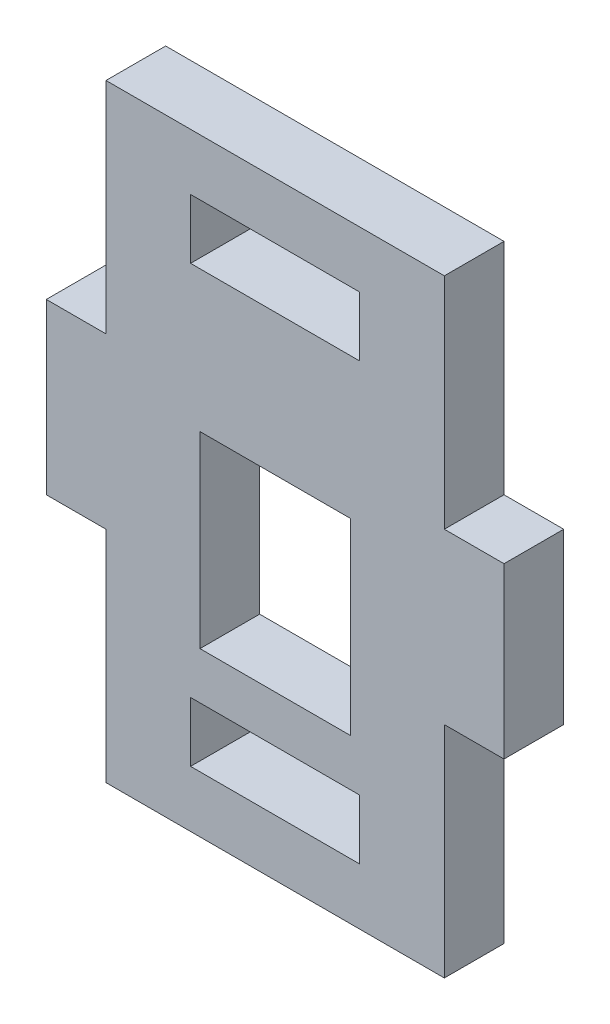
ISO-10303-21;
HEADER;
FILE_DESCRIPTION(('STEP AP214'),'2;1');
FILE_NAME('part.step','',(''),(''),'','','');
FILE_SCHEMA(('AUTOMOTIVE_DESIGN { 1 0 10303 214 1 1 1 1 }'));
ENDSEC;
DATA;
#1=APPLICATION_CONTEXT('core data for automotive mechanical design processes');
#2=APPLICATION_PROTOCOL_DEFINITION('international standard','automotive_design',2000,#1);
#3=PRODUCT_CONTEXT('',#1,'mechanical');
#4=PRODUCT('Part','Part','',(#3));
#5=PRODUCT_RELATED_PRODUCT_CATEGORY('part','',(#4));
#6=PRODUCT_DEFINITION_FORMATION('','',#4);
#7=PRODUCT_DEFINITION_CONTEXT('part definition',#1,'design');
#8=PRODUCT_DEFINITION('design','',#6,#7);
#9=PRODUCT_DEFINITION_SHAPE('','',#8);
#10=(LENGTH_UNIT() NAMED_UNIT(*) SI_UNIT(.MILLI.,.METRE.));
#11=(NAMED_UNIT(*) PLANE_ANGLE_UNIT() SI_UNIT($,.RADIAN.));
#12=(NAMED_UNIT(*) SI_UNIT($,.STERADIAN.) SOLID_ANGLE_UNIT());
#13=UNCERTAINTY_MEASURE_WITH_UNIT(LENGTH_MEASURE(1.E-05),#10,'distance_accuracy_value','');
#14=(GEOMETRIC_REPRESENTATION_CONTEXT(3) GLOBAL_UNCERTAINTY_ASSIGNED_CONTEXT((#13)) GLOBAL_UNIT_ASSIGNED_CONTEXT((#10,
#11,#12)) REPRESENTATION_CONTEXT('',''));
#15=CARTESIAN_POINT('',(0.,0.,0.));
#16=DIRECTION('',(0.,0.,1.));
#17=DIRECTION('',(1.,0.,0.));
#18=AXIS2_PLACEMENT_3D('',#15,#16,#17);
#19=CARTESIAN_POINT('',(0.,3.,1.5875));
#20=DIRECTION('',(0.,-1.,0.));
#21=DIRECTION('',(0.,0.,-1.));
#22=AXIS2_PLACEMENT_3D('',#19,#20,#21);
#23=PLANE('',#22);
#24=DIRECTION('',(-1.,0.,0.));
#25=VECTOR('',#24,1.);
#26=CARTESIAN_POINT('',(0.,3.,-1.5875));
#27=LINE('',#26,#25);
#28=CARTESIAN_POINT('',(13.5,3.,-1.5875));
#29=VERTEX_POINT('',#28);
#30=CARTESIAN_POINT('',(4.5,3.,-1.5875));
#31=VERTEX_POINT('',#30);
#32=EDGE_CURVE('E275',#29,#31,#27,.T.);
#33=ORIENTED_EDGE('',*,*,#32,.T.);
#34=DIRECTION('',(0.,0.,-1.));
#35=VECTOR('',#34,1.);
#36=CARTESIAN_POINT('',(4.5,3.,1.5875));
#37=LINE('',#36,#35);
#38=CARTESIAN_POINT('',(4.5,3.,1.5875));
#39=VERTEX_POINT('',#38);
#40=EDGE_CURVE('E11',#39,#31,#37,.T.);
#41=ORIENTED_EDGE('',*,*,#40,.F.);
#42=DIRECTION('',(-1.,0.,0.));
#43=VECTOR('',#42,1.);
#44=CARTESIAN_POINT('',(0.,3.,1.5875));
#45=LINE('',#44,#43);
#46=CARTESIAN_POINT('',(13.5,3.,1.5875));
#47=VERTEX_POINT('',#46);
#48=EDGE_CURVE('E212',#47,#39,#45,.T.);
#49=ORIENTED_EDGE('',*,*,#48,.F.);
#50=DIRECTION('',(0.,0.,-1.));
#51=VECTOR('',#50,1.);
#52=CARTESIAN_POINT('',(13.5,3.,1.5875));
#53=LINE('',#52,#51);
#54=EDGE_CURVE('E282',#47,#29,#53,.T.);
#55=ORIENTED_EDGE('',*,*,#54,.T.);
#56=EDGE_LOOP('',(#33,#41,#49,#55));
#57=FACE_BOUND('',#56,.T.);
#58=ADVANCED_FACE('F34',(#57),#23,.F.);
#59=CARTESIAN_POINT('',(4.5,0.,1.5875));
#60=DIRECTION('',(-1.,0.,0.));
#61=DIRECTION('',(0.,0.,1.));
#62=AXIS2_PLACEMENT_3D('',#59,#60,#61);
#63=PLANE('',#62);
#64=DIRECTION('',(0.,1.,0.));
#65=VECTOR('',#64,1.);
#66=CARTESIAN_POINT('',(4.5,0.,-1.5875));
#67=LINE('',#66,#65);
#68=CARTESIAN_POINT('',(4.5,6.175,-1.5875));
#69=VERTEX_POINT('',#68);
#70=EDGE_CURVE('E217',#31,#69,#67,.T.);
#71=ORIENTED_EDGE('',*,*,#70,.T.);
#72=DIRECTION('',(0.,0.,-1.));
#73=VECTOR('',#72,1.);
#74=CARTESIAN_POINT('',(4.5,6.175,1.5875));
#75=LINE('',#74,#73);
#76=CARTESIAN_POINT('',(4.5,6.175,1.5875));
#77=VERTEX_POINT('',#76);
#78=EDGE_CURVE('E44',#77,#69,#75,.T.);
#79=ORIENTED_EDGE('',*,*,#78,.F.);
#80=DIRECTION('',(0.,1.,0.));
#81=VECTOR('',#80,1.);
#82=CARTESIAN_POINT('',(4.5,0.,1.5875));
#83=LINE('',#82,#81);
#84=EDGE_CURVE('E206',#39,#77,#83,.T.);
#85=ORIENTED_EDGE('',*,*,#84,.F.);
#86=ORIENTED_EDGE('',*,*,#40,.T.);
#87=EDGE_LOOP('',(#71,#79,#85,#86));
#88=FACE_BOUND('',#87,.T.);
#89=ADVANCED_FACE('F216',(#88),#63,.F.);
#90=CARTESIAN_POINT('',(0.,6.175,1.5875));
#91=DIRECTION('',(0.,1.,0.));
#92=DIRECTION('',(-1.,0.,0.));
#93=AXIS2_PLACEMENT_3D('',#90,#91,#92);
#94=PLANE('',#93);
#95=DIRECTION('',(1.,0.,0.));
#96=VECTOR('',#95,1.);
#97=CARTESIAN_POINT('',(0.,6.175,-1.5875));
#98=LINE('',#97,#96);
#99=CARTESIAN_POINT('',(13.5,6.175,-1.5875));
#100=VERTEX_POINT('',#99);
#101=EDGE_CURVE('E130',#69,#100,#98,.T.);
#102=ORIENTED_EDGE('',*,*,#101,.T.);
#103=DIRECTION('',(0.,0.,-1.));
#104=VECTOR('',#103,1.);
#105=CARTESIAN_POINT('',(13.5,6.175,1.5875));
#106=LINE('',#105,#104);
#107=CARTESIAN_POINT('',(13.5,6.175,1.5875));
#108=VERTEX_POINT('',#107);
#109=EDGE_CURVE('E218',#108,#100,#106,.T.);
#110=ORIENTED_EDGE('',*,*,#109,.F.);
#111=DIRECTION('',(1.,0.,0.));
#112=VECTOR('',#111,1.);
#113=CARTESIAN_POINT('',(0.,6.175,1.5875));
#114=LINE('',#113,#112);
#115=EDGE_CURVE('E210',#77,#108,#114,.T.);
#116=ORIENTED_EDGE('',*,*,#115,.F.);
#117=ORIENTED_EDGE('',*,*,#78,.T.);
#118=EDGE_LOOP('',(#102,#110,#116,#117));
#119=FACE_BOUND('',#118,.T.);
#120=ADVANCED_FACE('F220',(#119),#94,.F.);
#121=CARTESIAN_POINT('',(0.,29.35,1.5875));
#122=DIRECTION('',(0.,-1.,0.));
#123=DIRECTION('',(0.,0.,-1.));
#124=AXIS2_PLACEMENT_3D('',#121,#122,#123);
#125=PLANE('',#124);
#126=DIRECTION('',(-1.,0.,0.));
#127=VECTOR('',#126,1.);
#128=CARTESIAN_POINT('',(0.,29.35,-1.5875));
#129=LINE('',#128,#127);
#130=CARTESIAN_POINT('',(13.5,29.35,-1.5875));
#131=VERTEX_POINT('',#130);
#132=CARTESIAN_POINT('',(4.5,29.35,-1.5875));
#133=VERTEX_POINT('',#132);
#134=EDGE_CURVE('E263',#131,#133,#129,.T.);
#135=ORIENTED_EDGE('',*,*,#134,.F.);
#136=DIRECTION('',(0.,0.,-1.));
#137=VECTOR('',#136,1.);
#138=CARTESIAN_POINT('',(13.5,29.35,1.5875));
#139=LINE('',#138,#137);
#140=CARTESIAN_POINT('',(13.5,29.35,1.5875));
#141=VERTEX_POINT('',#140);
#142=EDGE_CURVE('E284',#141,#131,#139,.T.);
#143=ORIENTED_EDGE('',*,*,#142,.F.);
#144=DIRECTION('',(-1.,0.,0.));
#145=VECTOR('',#144,1.);
#146=CARTESIAN_POINT('',(0.,29.35,1.5875));
#147=LINE('',#146,#145);
#148=CARTESIAN_POINT('',(4.5,29.35,1.5875));
#149=VERTEX_POINT('',#148);
#150=EDGE_CURVE('E389',#141,#149,#147,.T.);
#151=ORIENTED_EDGE('',*,*,#150,.T.);
#152=DIRECTION('',(0.,0.,-1.));
#153=VECTOR('',#152,1.);
#154=CARTESIAN_POINT('',(4.5,29.35,1.5875));
#155=LINE('',#154,#153);
#156=EDGE_CURVE('E286',#149,#133,#155,.T.);
#157=ORIENTED_EDGE('',*,*,#156,.T.);
#158=EDGE_LOOP('',(#135,#143,#151,#157));
#159=FACE_BOUND('',#158,.T.);
#160=ADVANCED_FACE('F416',(#159),#125,.T.);
#161=CARTESIAN_POINT('',(13.5,0.,1.5875));
#162=DIRECTION('',(-1.,0.,0.));
#163=DIRECTION('',(0.,0.,1.));
#164=AXIS2_PLACEMENT_3D('',#161,#162,#163);
#165=PLANE('',#164);
#166=DIRECTION('',(0.,1.,0.));
#167=VECTOR('',#166,1.);
#168=CARTESIAN_POINT('',(13.5,0.,-1.5875));
#169=LINE('',#168,#167);
#170=CARTESIAN_POINT('',(13.5,26.175,-1.5875));
#171=VERTEX_POINT('',#170);
#172=EDGE_CURVE('E266',#171,#131,#169,.T.);
#173=ORIENTED_EDGE('',*,*,#172,.F.);
#174=DIRECTION('',(0.,0.,-1.));
#175=VECTOR('',#174,1.);
#176=CARTESIAN_POINT('',(13.5,26.175,1.5875));
#177=LINE('',#176,#175);
#178=CARTESIAN_POINT('',(13.5,26.175,1.5875));
#179=VERTEX_POINT('',#178);
#180=EDGE_CURVE('E291',#179,#171,#177,.T.);
#181=ORIENTED_EDGE('',*,*,#180,.F.);
#182=DIRECTION('',(0.,1.,0.));
#183=VECTOR('',#182,1.);
#184=CARTESIAN_POINT('',(13.5,0.,1.5875));
#185=LINE('',#184,#183);
#186=EDGE_CURVE('E392',#179,#141,#185,.T.);
#187=ORIENTED_EDGE('',*,*,#186,.T.);
#188=ORIENTED_EDGE('',*,*,#142,.T.);
#189=EDGE_LOOP('',(#173,#181,#187,#188));
#190=FACE_BOUND('',#189,.T.);
#191=ADVANCED_FACE('F418',(#190),#165,.T.);
#192=CARTESIAN_POINT('',(0.,26.175,1.5875));
#193=DIRECTION('',(0.,1.,0.));
#194=DIRECTION('',(-1.,0.,0.));
#195=AXIS2_PLACEMENT_3D('',#192,#193,#194);
#196=PLANE('',#195);
#197=DIRECTION('',(1.,0.,0.));
#198=VECTOR('',#197,1.);
#199=CARTESIAN_POINT('',(0.,26.175,-1.5875));
#200=LINE('',#199,#198);
#201=CARTESIAN_POINT('',(4.5,26.175,-1.5875));
#202=VERTEX_POINT('',#201);
#203=EDGE_CURVE('E269',#202,#171,#200,.T.);
#204=ORIENTED_EDGE('',*,*,#203,.F.);
#205=DIRECTION('',(0.,0.,-1.));
#206=VECTOR('',#205,1.);
#207=CARTESIAN_POINT('',(4.5,26.175,1.5875));
#208=LINE('',#207,#206);
#209=CARTESIAN_POINT('',(4.5,26.175,1.5875));
#210=VERTEX_POINT('',#209);
#211=EDGE_CURVE('E288',#210,#202,#208,.T.);
#212=ORIENTED_EDGE('',*,*,#211,.F.);
#213=DIRECTION('',(1.,0.,0.));
#214=VECTOR('',#213,1.);
#215=CARTESIAN_POINT('',(0.,26.175,1.5875));
#216=LINE('',#215,#214);
#217=EDGE_CURVE('E395',#210,#179,#216,.T.);
#218=ORIENTED_EDGE('',*,*,#217,.T.);
#219=ORIENTED_EDGE('',*,*,#180,.T.);
#220=EDGE_LOOP('',(#204,#212,#218,#219));
#221=FACE_BOUND('',#220,.T.);
#222=ADVANCED_FACE('F410',(#221),#196,.T.);
#223=CARTESIAN_POINT('',(0.,8.675,1.5875));
#224=DIRECTION('',(0.,1.,0.));
#225=DIRECTION('',(0.,0.,1.));
#226=AXIS2_PLACEMENT_3D('',#223,#224,#225);
#227=PLANE('',#226);
#228=DIRECTION('',(1.,0.,0.));
#229=VECTOR('',#228,1.);
#230=CARTESIAN_POINT('',(0.,8.675,-1.5875));
#231=LINE('',#230,#229);
#232=CARTESIAN_POINT('',(5.,8.675,-1.5875));
#233=VERTEX_POINT('',#232);
#234=CARTESIAN_POINT('',(13.,8.675,-1.5875));
#235=VERTEX_POINT('',#234);
#236=EDGE_CURVE('E251',#233,#235,#231,.T.);
#237=ORIENTED_EDGE('',*,*,#236,.F.);
#238=DIRECTION('',(0.,0.,-1.));
#239=VECTOR('',#238,1.);
#240=CARTESIAN_POINT('',(5.,8.675,1.5875));
#241=LINE('',#240,#239);
#242=CARTESIAN_POINT('',(5.,8.675,1.5875));
#243=VERTEX_POINT('',#242);
#244=EDGE_CURVE('E289',#243,#233,#241,.T.);
#245=ORIENTED_EDGE('',*,*,#244,.F.);
#246=DIRECTION('',(1.,0.,0.));
#247=VECTOR('',#246,1.);
#248=CARTESIAN_POINT('',(0.,8.675,1.5875));
#249=LINE('',#248,#247);
#250=CARTESIAN_POINT('',(13.,8.675,1.5875));
#251=VERTEX_POINT('',#250);
#252=EDGE_CURVE('E377',#243,#251,#249,.T.);
#253=ORIENTED_EDGE('',*,*,#252,.T.);
#254=DIRECTION('',(0.,0.,-1.));
#255=VECTOR('',#254,1.);
#256=CARTESIAN_POINT('',(13.,8.675,1.5875));
#257=LINE('',#256,#255);
#258=EDGE_CURVE('E294',#251,#235,#257,.T.);
#259=ORIENTED_EDGE('',*,*,#258,.T.);
#260=EDGE_LOOP('',(#237,#245,#253,#259));
#261=FACE_BOUND('',#260,.T.);
#262=ADVANCED_FACE('F425',(#261),#227,.T.);
#263=CARTESIAN_POINT('',(5.,0.,1.5875));
#264=DIRECTION('',(1.,0.,0.));
#265=DIRECTION('',(0.,1.,0.));
#266=AXIS2_PLACEMENT_3D('',#263,#264,#265);
#267=PLANE('',#266);
#268=DIRECTION('',(0.,-1.,0.));
#269=VECTOR('',#268,1.);
#270=CARTESIAN_POINT('',(5.,0.,-1.5875));
#271=LINE('',#270,#269);
#272=CARTESIAN_POINT('',(5.,18.675,-1.5875));
#273=VERTEX_POINT('',#272);
#274=EDGE_CURVE('E254',#273,#233,#271,.T.);
#275=ORIENTED_EDGE('',*,*,#274,.F.);
#276=DIRECTION('',(0.,0.,-1.));
#277=VECTOR('',#276,1.);
#278=CARTESIAN_POINT('',(5.,18.675,1.5875));
#279=LINE('',#278,#277);
#280=CARTESIAN_POINT('',(5.,18.675,1.5875));
#281=VERTEX_POINT('',#280);
#282=EDGE_CURVE('E298',#281,#273,#279,.T.);
#283=ORIENTED_EDGE('',*,*,#282,.F.);
#284=DIRECTION('',(0.,-1.,0.));
#285=VECTOR('',#284,1.);
#286=CARTESIAN_POINT('',(5.,0.,1.5875));
#287=LINE('',#286,#285);
#288=EDGE_CURVE('E380',#281,#243,#287,.T.);
#289=ORIENTED_EDGE('',*,*,#288,.T.);
#290=ORIENTED_EDGE('',*,*,#244,.T.);
#291=EDGE_LOOP('',(#275,#283,#289,#290));
#292=FACE_BOUND('',#291,.T.);
#293=ADVANCED_FACE('F489',(#292),#267,.T.);
#294=CARTESIAN_POINT('',(0.,18.675,1.5875));
#295=DIRECTION('',(0.,-1.,0.));
#296=DIRECTION('',(0.,0.,-1.));
#297=AXIS2_PLACEMENT_3D('',#294,#295,#296);
#298=PLANE('',#297);
#299=DIRECTION('',(-1.,0.,0.));
#300=VECTOR('',#299,1.);
#301=CARTESIAN_POINT('',(0.,18.675,-1.5875));
#302=LINE('',#301,#300);
#303=CARTESIAN_POINT('',(13.,18.675,-1.5875));
#304=VERTEX_POINT('',#303);
#305=EDGE_CURVE('E257',#304,#273,#302,.T.);
#306=ORIENTED_EDGE('',*,*,#305,.F.);
#307=DIRECTION('',(0.,0.,-1.));
#308=VECTOR('',#307,1.);
#309=CARTESIAN_POINT('',(13.,18.675,1.5875));
#310=LINE('',#309,#308);
#311=CARTESIAN_POINT('',(13.,18.675,1.5875));
#312=VERTEX_POINT('',#311);
#313=EDGE_CURVE('E296',#312,#304,#310,.T.);
#314=ORIENTED_EDGE('',*,*,#313,.F.);
#315=DIRECTION('',(-1.,0.,0.));
#316=VECTOR('',#315,1.);
#317=CARTESIAN_POINT('',(0.,18.675,1.5875));
#318=LINE('',#317,#316);
#319=EDGE_CURVE('E383',#312,#281,#318,.T.);
#320=ORIENTED_EDGE('',*,*,#319,.T.);
#321=ORIENTED_EDGE('',*,*,#282,.T.);
#322=EDGE_LOOP('',(#306,#314,#320,#321));
#323=FACE_BOUND('',#322,.T.);
#324=ADVANCED_FACE('F485',(#323),#298,.T.);
#325=CARTESIAN_POINT('',(0.,20.675,1.5875));
#326=DIRECTION('',(0.,-1.,0.));
#327=DIRECTION('',(0.,0.,-1.));
#328=AXIS2_PLACEMENT_3D('',#325,#326,#327);
#329=PLANE('',#328);
#330=DIRECTION('',(-1.,0.,0.));
#331=VECTOR('',#330,1.);
#332=CARTESIAN_POINT('',(0.,20.675,-1.5875));
#333=LINE('',#332,#331);
#334=CARTESIAN_POINT('',(21.175,20.675,-1.5875));
#335=VERTEX_POINT('',#334);
#336=CARTESIAN_POINT('',(18.,20.675,-1.5875));
#337=VERTEX_POINT('',#336);
#338=EDGE_CURVE('E226',#335,#337,#333,.T.);
#339=ORIENTED_EDGE('',*,*,#338,.T.);
#340=DIRECTION('',(0.,0.,-1.));
#341=VECTOR('',#340,1.);
#342=CARTESIAN_POINT('',(18.,20.675,1.5875));
#343=LINE('',#342,#341);
#344=CARTESIAN_POINT('',(18.,20.675,1.5875));
#345=VERTEX_POINT('',#344);
#346=EDGE_CURVE('E38',#345,#337,#343,.T.);
#347=ORIENTED_EDGE('',*,*,#346,.F.);
#348=DIRECTION('',(-1.,0.,0.));
#349=VECTOR('',#348,1.);
#350=CARTESIAN_POINT('',(0.,20.675,1.5875));
#351=LINE('',#350,#349);
#352=CARTESIAN_POINT('',(21.175,20.675,1.5875));
#353=VERTEX_POINT('',#352);
#354=EDGE_CURVE('E281',#353,#345,#351,.T.);
#355=ORIENTED_EDGE('',*,*,#354,.F.);
#356=DIRECTION('',(0.,0.,-1.));
#357=VECTOR('',#356,1.);
#358=CARTESIAN_POINT('',(21.175,20.675,1.5875));
#359=LINE('',#358,#357);
#360=EDGE_CURVE('E222',#353,#335,#359,.T.);
#361=ORIENTED_EDGE('',*,*,#360,.T.);
#362=EDGE_LOOP('',(#339,#347,#355,#361));
#363=FACE_BOUND('',#362,.T.);
#364=ADVANCED_FACE('F36',(#363),#329,.F.);
#365=CARTESIAN_POINT('',(18.,0.,1.5875));
#366=DIRECTION('',(-1.,0.,0.));
#367=DIRECTION('',(0.,-1.,0.));
#368=AXIS2_PLACEMENT_3D('',#365,#366,#367);
#369=PLANE('',#368);
#370=DIRECTION('',(0.,1.,0.));
#371=VECTOR('',#370,1.);
#372=CARTESIAN_POINT('',(18.,0.,-1.5875));
#373=LINE('',#372,#371);
#374=CARTESIAN_POINT('',(18.,32.35,-1.5875));
#375=VERTEX_POINT('',#374);
#376=EDGE_CURVE('E229',#337,#375,#373,.T.);
#377=ORIENTED_EDGE('',*,*,#376,.T.);
#378=DIRECTION('',(0.,0.,-1.));
#379=VECTOR('',#378,1.);
#380=CARTESIAN_POINT('',(18.,32.35,1.5875));
#381=LINE('',#380,#379);
#382=CARTESIAN_POINT('',(18.,32.35,1.5875));
#383=VERTEX_POINT('',#382);
#384=EDGE_CURVE('E329',#383,#375,#381,.T.);
#385=ORIENTED_EDGE('',*,*,#384,.F.);
#386=DIRECTION('',(0.,1.,0.));
#387=VECTOR('',#386,1.);
#388=CARTESIAN_POINT('',(18.,0.,1.5875));
#389=LINE('',#388,#387);
#390=EDGE_CURVE('E145',#345,#383,#389,.T.);
#391=ORIENTED_EDGE('',*,*,#390,.F.);
#392=ORIENTED_EDGE('',*,*,#346,.T.);
#393=EDGE_LOOP('',(#377,#385,#391,#392));
#394=FACE_BOUND('',#393,.T.);
#395=ADVANCED_FACE('F335',(#394),#369,.F.);
#396=CARTESIAN_POINT('',(0.,32.35,1.5875));
#397=DIRECTION('',(0.,-1.,0.));
#398=DIRECTION('',(1.,0.,0.));
#399=AXIS2_PLACEMENT_3D('',#396,#397,#398);
#400=PLANE('',#399);
#401=DIRECTION('',(-1.,0.,0.));
#402=VECTOR('',#401,1.);
#403=CARTESIAN_POINT('',(0.,32.35,-1.5875));
#404=LINE('',#403,#402);
#405=CARTESIAN_POINT('',(0.,32.35,-1.5875));
#406=VERTEX_POINT('',#405);
#407=EDGE_CURVE('E231',#375,#406,#404,.T.);
#408=ORIENTED_EDGE('',*,*,#407,.T.);
#409=DIRECTION('',(0.,0.,-1.));
#410=VECTOR('',#409,1.);
#411=CARTESIAN_POINT('',(0.,32.35,1.5875));
#412=LINE('',#411,#410);
#413=CARTESIAN_POINT('',(0.,32.35,1.5875));
#414=VERTEX_POINT('',#413);
#415=EDGE_CURVE('E327',#414,#406,#412,.T.);
#416=ORIENTED_EDGE('',*,*,#415,.F.);
#417=DIRECTION('',(-1.,0.,0.));
#418=VECTOR('',#417,1.);
#419=CARTESIAN_POINT('',(0.,32.35,1.5875));
#420=LINE('',#419,#418);
#421=EDGE_CURVE('E357',#383,#414,#420,.T.);
#422=ORIENTED_EDGE('',*,*,#421,.F.);
#423=ORIENTED_EDGE('',*,*,#384,.T.);
#424=EDGE_LOOP('',(#408,#416,#422,#423));
#425=FACE_BOUND('',#424,.T.);
#426=ADVANCED_FACE('F348',(#425),#400,.F.);
#427=CARTESIAN_POINT('',(0.,0.,1.5875));
#428=DIRECTION('',(1.,0.,0.));
#429=DIRECTION('',(0.,1.,0.));
#430=AXIS2_PLACEMENT_3D('',#427,#428,#429);
#431=PLANE('',#430);
#432=DIRECTION('',(0.,-1.,0.));
#433=VECTOR('',#432,1.);
#434=CARTESIAN_POINT('',(0.,0.,-1.5875));
#435=LINE('',#434,#433);
#436=CARTESIAN_POINT('',(0.,20.675,-1.5875));
#437=VERTEX_POINT('',#436);
#438=EDGE_CURVE('E233',#406,#437,#435,.T.);
#439=ORIENTED_EDGE('',*,*,#438,.T.);
#440=DIRECTION('',(0.,0.,-1.));
#441=VECTOR('',#440,1.);
#442=CARTESIAN_POINT('',(0.,20.675,1.5875));
#443=LINE('',#442,#441);
#444=CARTESIAN_POINT('',(0.,20.675,1.5875));
#445=VERTEX_POINT('',#444);
#446=EDGE_CURVE('E324',#445,#437,#443,.T.);
#447=ORIENTED_EDGE('',*,*,#446,.F.);
#448=DIRECTION('',(0.,-1.,0.));
#449=VECTOR('',#448,1.);
#450=CARTESIAN_POINT('',(0.,0.,1.5875));
#451=LINE('',#450,#449);
#452=EDGE_CURVE('E353',#414,#445,#451,.T.);
#453=ORIENTED_EDGE('',*,*,#452,.F.);
#454=ORIENTED_EDGE('',*,*,#415,.T.);
#455=EDGE_LOOP('',(#439,#447,#453,#454));
#456=FACE_BOUND('',#455,.T.);
#457=ADVANCED_FACE('F351',(#456),#431,.F.);
#458=CARTESIAN_POINT('',(0.,20.675,1.5875));
#459=DIRECTION('',(0.,-1.,0.));
#460=DIRECTION('',(0.,0.,-1.));
#461=AXIS2_PLACEMENT_3D('',#458,#459,#460);
#462=PLANE('',#461);
#463=DIRECTION('',(-1.,0.,0.));
#464=VECTOR('',#463,1.);
#465=CARTESIAN_POINT('',(0.,20.675,-1.5875));
#466=LINE('',#465,#464);
#467=CARTESIAN_POINT('',(-3.17499999999998,20.675,-1.5875));
#468=VERTEX_POINT('',#467);
#469=EDGE_CURVE('E235',#437,#468,#466,.T.);
#470=ORIENTED_EDGE('',*,*,#469,.T.);
#471=DIRECTION('',(0.,0.,-1.));
#472=VECTOR('',#471,1.);
#473=CARTESIAN_POINT('',(-3.17499999999998,20.675,1.5875));
#474=LINE('',#473,#472);
#475=CARTESIAN_POINT('',(-3.17499999999998,20.675,1.5875));
#476=VERTEX_POINT('',#475);
#477=EDGE_CURVE('E321',#476,#468,#474,.T.);
#478=ORIENTED_EDGE('',*,*,#477,.F.);
#479=DIRECTION('',(-1.,0.,0.));
#480=VECTOR('',#479,1.);
#481=CARTESIAN_POINT('',(0.,20.675,1.5875));
#482=LINE('',#481,#480);
#483=EDGE_CURVE('E356',#445,#476,#482,.T.);
#484=ORIENTED_EDGE('',*,*,#483,.F.);
#485=ORIENTED_EDGE('',*,*,#446,.T.);
#486=EDGE_LOOP('',(#470,#478,#484,#485));
#487=FACE_BOUND('',#486,.T.);
#488=ADVANCED_FACE('F473',(#487),#462,.F.);
#489=CARTESIAN_POINT('',(-3.17499999999998,0.,1.5875));
#490=DIRECTION('',(1.,0.,0.));
#491=DIRECTION('',(0.,1.,0.));
#492=AXIS2_PLACEMENT_3D('',#489,#490,#491);
#493=PLANE('',#492);
#494=DIRECTION('',(0.,-1.,0.));
#495=VECTOR('',#494,1.);
#496=CARTESIAN_POINT('',(-3.17499999999998,0.,-1.5875));
#497=LINE('',#496,#495);
#498=CARTESIAN_POINT('',(-3.17499999999998,11.675,-1.5875));
#499=VERTEX_POINT('',#498);
#500=EDGE_CURVE('E237',#468,#499,#497,.T.);
#501=ORIENTED_EDGE('',*,*,#500,.T.);
#502=DIRECTION('',(0.,0.,-1.));
#503=VECTOR('',#502,1.);
#504=CARTESIAN_POINT('',(-3.17499999999998,11.675,1.5875));
#505=LINE('',#504,#503);
#506=CARTESIAN_POINT('',(-3.17499999999998,11.675,1.5875));
#507=VERTEX_POINT('',#506);
#508=EDGE_CURVE('E318',#507,#499,#505,.T.);
#509=ORIENTED_EDGE('',*,*,#508,.F.);
#510=DIRECTION('',(0.,-1.,0.));
#511=VECTOR('',#510,1.);
#512=CARTESIAN_POINT('',(-3.17499999999998,0.,1.5875));
#513=LINE('',#512,#511);
#514=EDGE_CURVE('E359',#476,#507,#513,.T.);
#515=ORIENTED_EDGE('',*,*,#514,.F.);
#516=ORIENTED_EDGE('',*,*,#477,.T.);
#517=EDGE_LOOP('',(#501,#509,#515,#516));
#518=FACE_BOUND('',#517,.T.);
#519=ADVANCED_FACE('F469',(#518),#493,.F.);
#520=CARTESIAN_POINT('',(0.,11.675,1.5875));
#521=DIRECTION('',(0.,1.,0.));
#522=DIRECTION('',(-1.,0.,0.));
#523=AXIS2_PLACEMENT_3D('',#520,#521,#522);
#524=PLANE('',#523);
#525=DIRECTION('',(1.,0.,0.));
#526=VECTOR('',#525,1.);
#527=CARTESIAN_POINT('',(0.,11.675,-1.5875));
#528=LINE('',#527,#526);
#529=CARTESIAN_POINT('',(0.,11.675,-1.5875));
#530=VERTEX_POINT('',#529);
#531=EDGE_CURVE('E239',#499,#530,#528,.T.);
#532=ORIENTED_EDGE('',*,*,#531,.T.);
#533=DIRECTION('',(0.,0.,-1.));
#534=VECTOR('',#533,1.);
#535=CARTESIAN_POINT('',(0.,11.675,1.5875));
#536=LINE('',#535,#534);
#537=CARTESIAN_POINT('',(0.,11.675,1.5875));
#538=VERTEX_POINT('',#537);
#539=EDGE_CURVE('E315',#538,#530,#536,.T.);
#540=ORIENTED_EDGE('',*,*,#539,.F.);
#541=DIRECTION('',(1.,0.,0.));
#542=VECTOR('',#541,1.);
#543=CARTESIAN_POINT('',(0.,11.675,1.5875));
#544=LINE('',#543,#542);
#545=EDGE_CURVE('E365',#507,#538,#544,.T.);
#546=ORIENTED_EDGE('',*,*,#545,.F.);
#547=ORIENTED_EDGE('',*,*,#508,.T.);
#548=EDGE_LOOP('',(#532,#540,#546,#547));
#549=FACE_BOUND('',#548,.T.);
#550=ADVANCED_FACE('F465',(#549),#524,.F.);
#551=CARTESIAN_POINT('',(0.,0.,1.5875));
#552=DIRECTION('',(1.,0.,0.));
#553=DIRECTION('',(0.,0.,-1.));
#554=AXIS2_PLACEMENT_3D('',#551,#552,#553);
#555=PLANE('',#554);
#556=DIRECTION('',(0.,-1.,0.));
#557=VECTOR('',#556,1.);
#558=CARTESIAN_POINT('',(0.,0.,-1.5875));
#559=LINE('',#558,#557);
#560=CARTESIAN_POINT('',(0.,0.,-1.5875));
#561=VERTEX_POINT('',#560);
#562=EDGE_CURVE('E241',#530,#561,#559,.T.);
#563=ORIENTED_EDGE('',*,*,#562,.T.);
#564=DIRECTION('',(0.,0.,-1.));
#565=VECTOR('',#564,1.);
#566=CARTESIAN_POINT('',(0.,0.,1.5875));
#567=LINE('',#566,#565);
#568=CARTESIAN_POINT('',(0.,0.,1.5875));
#569=VERTEX_POINT('',#568);
#570=EDGE_CURVE('E312',#569,#561,#567,.T.);
#571=ORIENTED_EDGE('',*,*,#570,.F.);
#572=DIRECTION('',(0.,-1.,0.));
#573=VECTOR('',#572,1.);
#574=CARTESIAN_POINT('',(0.,0.,1.5875));
#575=LINE('',#574,#573);
#576=EDGE_CURVE('E367',#538,#569,#575,.T.);
#577=ORIENTED_EDGE('',*,*,#576,.F.);
#578=ORIENTED_EDGE('',*,*,#539,.T.);
#579=EDGE_LOOP('',(#563,#571,#577,#578));
#580=FACE_BOUND('',#579,.T.);
#581=ADVANCED_FACE('F461',(#580),#555,.F.);
#582=CARTESIAN_POINT('',(0.,0.,1.5875));
#583=DIRECTION('',(0.,1.,0.));
#584=DIRECTION('',(0.,0.,1.));
#585=AXIS2_PLACEMENT_3D('',#582,#583,#584);
#586=PLANE('',#585);
#587=DIRECTION('',(1.,0.,0.));
#588=VECTOR('',#587,1.);
#589=CARTESIAN_POINT('',(0.,0.,-1.5875));
#590=LINE('',#589,#588);
#591=CARTESIAN_POINT('',(18.,0.,-1.5875));
#592=VERTEX_POINT('',#591);
#593=EDGE_CURVE('E243',#561,#592,#590,.T.);
#594=ORIENTED_EDGE('',*,*,#593,.T.);
#595=DIRECTION('',(0.,0.,-1.));
#596=VECTOR('',#595,1.);
#597=CARTESIAN_POINT('',(18.,0.,1.5875));
#598=LINE('',#597,#596);
#599=CARTESIAN_POINT('',(18.,0.,1.5875));
#600=VERTEX_POINT('',#599);
#601=EDGE_CURVE('E309',#600,#592,#598,.T.);
#602=ORIENTED_EDGE('',*,*,#601,.F.);
#603=DIRECTION('',(1.,0.,0.));
#604=VECTOR('',#603,1.);
#605=CARTESIAN_POINT('',(0.,0.,1.5875));
#606=LINE('',#605,#604);
#607=EDGE_CURVE('E369',#569,#600,#606,.T.);
#608=ORIENTED_EDGE('',*,*,#607,.F.);
#609=ORIENTED_EDGE('',*,*,#570,.T.);
#610=EDGE_LOOP('',(#594,#602,#608,#609));
#611=FACE_BOUND('',#610,.T.);
#612=ADVANCED_FACE('F453',(#611),#586,.F.);
#613=CARTESIAN_POINT('',(18.,0.,1.5875));
#614=DIRECTION('',(-1.,0.,0.));
#615=DIRECTION('',(0.,0.,1.));
#616=AXIS2_PLACEMENT_3D('',#613,#614,#615);
#617=PLANE('',#616);
#618=DIRECTION('',(0.,1.,0.));
#619=VECTOR('',#618,1.);
#620=CARTESIAN_POINT('',(18.,0.,-1.5875));
#621=LINE('',#620,#619);
#622=CARTESIAN_POINT('',(18.,11.675,-1.5875));
#623=VERTEX_POINT('',#622);
#624=EDGE_CURVE('E245',#592,#623,#621,.T.);
#625=ORIENTED_EDGE('',*,*,#624,.T.);
#626=DIRECTION('',(0.,0.,-1.));
#627=VECTOR('',#626,1.);
#628=CARTESIAN_POINT('',(18.,11.675,1.5875));
#629=LINE('',#628,#627);
#630=CARTESIAN_POINT('',(18.,11.675,1.5875));
#631=VERTEX_POINT('',#630);
#632=EDGE_CURVE('E306',#631,#623,#629,.T.);
#633=ORIENTED_EDGE('',*,*,#632,.F.);
#634=DIRECTION('',(0.,1.,0.));
#635=VECTOR('',#634,1.);
#636=CARTESIAN_POINT('',(18.,0.,1.5875));
#637=LINE('',#636,#635);
#638=EDGE_CURVE('E371',#600,#631,#637,.T.);
#639=ORIENTED_EDGE('',*,*,#638,.F.);
#640=ORIENTED_EDGE('',*,*,#601,.T.);
#641=EDGE_LOOP('',(#625,#633,#639,#640));
#642=FACE_BOUND('',#641,.T.);
#643=ADVANCED_FACE('F447',(#642),#617,.F.);
#644=CARTESIAN_POINT('',(0.,11.675,1.5875));
#645=DIRECTION('',(0.,1.,0.));
#646=DIRECTION('',(-1.,0.,0.));
#647=AXIS2_PLACEMENT_3D('',#644,#645,#646);
#648=PLANE('',#647);
#649=DIRECTION('',(1.,0.,0.));
#650=VECTOR('',#649,1.);
#651=CARTESIAN_POINT('',(0.,11.675,-1.5875));
#652=LINE('',#651,#650);
#653=CARTESIAN_POINT('',(21.175,11.675,-1.5875));
#654=VERTEX_POINT('',#653);
#655=EDGE_CURVE('E247',#623,#654,#652,.T.);
#656=ORIENTED_EDGE('',*,*,#655,.T.);
#657=DIRECTION('',(0.,0.,-1.));
#658=VECTOR('',#657,1.);
#659=CARTESIAN_POINT('',(21.175,11.675,1.5875));
#660=LINE('',#659,#658);
#661=CARTESIAN_POINT('',(21.175,11.675,1.5875));
#662=VERTEX_POINT('',#661);
#663=EDGE_CURVE('E303',#662,#654,#660,.T.);
#664=ORIENTED_EDGE('',*,*,#663,.F.);
#665=DIRECTION('',(1.,0.,0.));
#666=VECTOR('',#665,1.);
#667=CARTESIAN_POINT('',(0.,11.675,1.5875));
#668=LINE('',#667,#666);
#669=EDGE_CURVE('E373',#631,#662,#668,.T.);
#670=ORIENTED_EDGE('',*,*,#669,.F.);
#671=ORIENTED_EDGE('',*,*,#632,.T.);
#672=EDGE_LOOP('',(#656,#664,#670,#671));
#673=FACE_BOUND('',#672,.T.);
#674=ADVANCED_FACE('F439',(#673),#648,.F.);
#675=CARTESIAN_POINT('',(4.5,0.,1.5875));
#676=DIRECTION('',(1.,0.,0.));
#677=DIRECTION('',(0.,0.,-1.));
#678=AXIS2_PLACEMENT_3D('',#675,#676,#677);
#679=PLANE('',#678);
#680=DIRECTION('',(0.,-1.,0.));
#681=VECTOR('',#680,1.);
#682=CARTESIAN_POINT('',(4.5,0.,-1.5875));
#683=LINE('',#682,#681);
#684=EDGE_CURVE('E272',#133,#202,#683,.T.);
#685=ORIENTED_EDGE('',*,*,#684,.F.);
#686=ORIENTED_EDGE('',*,*,#156,.F.);
#687=DIRECTION('',(0.,-1.,0.));
#688=VECTOR('',#687,1.);
#689=CARTESIAN_POINT('',(4.5,0.,1.5875));
#690=LINE('',#689,#688);
#691=EDGE_CURVE('E398',#149,#210,#690,.T.);
#692=ORIENTED_EDGE('',*,*,#691,.T.);
#693=ORIENTED_EDGE('',*,*,#211,.T.);
#694=EDGE_LOOP('',(#685,#686,#692,#693));
#695=FACE_BOUND('',#694,.T.);
#696=ADVANCED_FACE('F403',(#695),#679,.T.);
#697=CARTESIAN_POINT('',(13.,0.,1.5875));
#698=DIRECTION('',(-1.,0.,0.));
#699=DIRECTION('',(0.,-1.,0.));
#700=AXIS2_PLACEMENT_3D('',#697,#698,#699);
#701=PLANE('',#700);
#702=DIRECTION('',(0.,1.,0.));
#703=VECTOR('',#702,1.);
#704=CARTESIAN_POINT('',(13.,0.,-1.5875));
#705=LINE('',#704,#703);
#706=EDGE_CURVE('E260',#235,#304,#705,.T.);
#707=ORIENTED_EDGE('',*,*,#706,.F.);
#708=ORIENTED_EDGE('',*,*,#258,.F.);
#709=DIRECTION('',(0.,1.,0.));
#710=VECTOR('',#709,1.);
#711=CARTESIAN_POINT('',(13.,0.,1.5875));
#712=LINE('',#711,#710);
#713=EDGE_CURVE('E386',#251,#312,#712,.T.);
#714=ORIENTED_EDGE('',*,*,#713,.T.);
#715=ORIENTED_EDGE('',*,*,#313,.T.);
#716=EDGE_LOOP('',(#707,#708,#714,#715));
#717=FACE_BOUND('',#716,.T.);
#718=ADVANCED_FACE('F438',(#717),#701,.T.);
#719=CARTESIAN_POINT('',(21.175,0.,1.5875));
#720=DIRECTION('',(-1.,0.,0.));
#721=DIRECTION('',(0.,-1.,0.));
#722=AXIS2_PLACEMENT_3D('',#719,#720,#721);
#723=PLANE('',#722);
#724=DIRECTION('',(0.,1.,0.));
#725=VECTOR('',#724,1.);
#726=CARTESIAN_POINT('',(21.175,0.,-1.5875));
#727=LINE('',#726,#725);
#728=EDGE_CURVE('E249',#654,#335,#727,.T.);
#729=ORIENTED_EDGE('',*,*,#728,.T.);
#730=ORIENTED_EDGE('',*,*,#360,.F.);
#731=DIRECTION('',(0.,1.,0.));
#732=VECTOR('',#731,1.);
#733=CARTESIAN_POINT('',(21.175,0.,1.5875));
#734=LINE('',#733,#732);
#735=EDGE_CURVE('E375',#662,#353,#734,.T.);
#736=ORIENTED_EDGE('',*,*,#735,.F.);
#737=ORIENTED_EDGE('',*,*,#663,.T.);
#738=EDGE_LOOP('',(#729,#730,#736,#737));
#739=FACE_BOUND('',#738,.T.);
#740=ADVANCED_FACE('F444',(#739),#723,.F.);
#741=CARTESIAN_POINT('',(13.5,0.,1.5875));
#742=DIRECTION('',(1.,0.,0.));
#743=DIRECTION('',(0.,0.,-1.));
#744=AXIS2_PLACEMENT_3D('',#741,#742,#743);
#745=PLANE('',#744);
#746=DIRECTION('',(0.,-1.,0.));
#747=VECTOR('',#746,1.);
#748=CARTESIAN_POINT('',(13.5,0.,-1.5875));
#749=LINE('',#748,#747);
#750=EDGE_CURVE('E136',#100,#29,#749,.T.);
#751=ORIENTED_EDGE('',*,*,#750,.T.);
#752=ORIENTED_EDGE('',*,*,#54,.F.);
#753=DIRECTION('',(0.,-1.,0.));
#754=VECTOR('',#753,1.);
#755=CARTESIAN_POINT('',(13.5,0.,1.5875));
#756=LINE('',#755,#754);
#757=EDGE_CURVE('E53',#108,#47,#756,.T.);
#758=ORIENTED_EDGE('',*,*,#757,.F.);
#759=ORIENTED_EDGE('',*,*,#109,.T.);
#760=EDGE_LOOP('',(#751,#752,#758,#759));
#761=FACE_BOUND('',#760,.T.);
#762=ADVANCED_FACE('F511',(#761),#745,.F.);
#763=CARTESIAN_POINT('',(0.,0.,1.5875));
#764=DIRECTION('',(0.,0.,1.));
#765=DIRECTION('',(1.,0.,0.));
#766=AXIS2_PLACEMENT_3D('',#763,#764,#765);
#767=PLANE('',#766);
#768=ORIENTED_EDGE('',*,*,#354,.T.);
#769=ORIENTED_EDGE('',*,*,#390,.T.);
#770=ORIENTED_EDGE('',*,*,#421,.T.);
#771=ORIENTED_EDGE('',*,*,#452,.T.);
#772=ORIENTED_EDGE('',*,*,#483,.T.);
#773=ORIENTED_EDGE('',*,*,#514,.T.);
#774=ORIENTED_EDGE('',*,*,#545,.T.);
#775=ORIENTED_EDGE('',*,*,#576,.T.);
#776=ORIENTED_EDGE('',*,*,#607,.T.);
#777=ORIENTED_EDGE('',*,*,#638,.T.);
#778=ORIENTED_EDGE('',*,*,#669,.T.);
#779=ORIENTED_EDGE('',*,*,#735,.T.);
#780=EDGE_LOOP('',(#768,#769,#770,#771,#772,#773,#774,#775,#776,#777,#778,#779));
#781=FACE_BOUND('',#780,.T.);
#782=ORIENTED_EDGE('',*,*,#252,.F.);
#783=ORIENTED_EDGE('',*,*,#288,.F.);
#784=ORIENTED_EDGE('',*,*,#319,.F.);
#785=ORIENTED_EDGE('',*,*,#713,.F.);
#786=EDGE_LOOP('',(#782,#783,#784,#785));
#787=FACE_BOUND('',#786,.T.);
#788=ORIENTED_EDGE('',*,*,#150,.F.);
#789=ORIENTED_EDGE('',*,*,#186,.F.);
#790=ORIENTED_EDGE('',*,*,#217,.F.);
#791=ORIENTED_EDGE('',*,*,#691,.F.);
#792=EDGE_LOOP('',(#788,#789,#790,#791));
#793=FACE_BOUND('',#792,.T.);
#794=ORIENTED_EDGE('',*,*,#48,.T.);
#795=ORIENTED_EDGE('',*,*,#84,.T.);
#796=ORIENTED_EDGE('',*,*,#115,.T.);
#797=ORIENTED_EDGE('',*,*,#757,.T.);
#798=EDGE_LOOP('',(#794,#795,#796,#797));
#799=FACE_BOUND('',#798,.T.);
#800=ADVANCED_FACE('F208',(#781,#787,#793,#799),#767,.T.);
#801=CARTESIAN_POINT('',(0.,0.,-1.5875));
#802=DIRECTION('',(0.,0.,1.));
#803=DIRECTION('',(1.,0.,0.));
#804=AXIS2_PLACEMENT_3D('',#801,#802,#803);
#805=PLANE('',#804);
#806=ORIENTED_EDGE('',*,*,#338,.F.);
#807=ORIENTED_EDGE('',*,*,#728,.F.);
#808=ORIENTED_EDGE('',*,*,#655,.F.);
#809=ORIENTED_EDGE('',*,*,#624,.F.);
#810=ORIENTED_EDGE('',*,*,#593,.F.);
#811=ORIENTED_EDGE('',*,*,#562,.F.);
#812=ORIENTED_EDGE('',*,*,#531,.F.);
#813=ORIENTED_EDGE('',*,*,#500,.F.);
#814=ORIENTED_EDGE('',*,*,#469,.F.);
#815=ORIENTED_EDGE('',*,*,#438,.F.);
#816=ORIENTED_EDGE('',*,*,#407,.F.);
#817=ORIENTED_EDGE('',*,*,#376,.F.);
#818=EDGE_LOOP('',(#806,#807,#808,#809,#810,#811,#812,#813,#814,#815,#816,#817));
#819=FACE_BOUND('',#818,.T.);
#820=ORIENTED_EDGE('',*,*,#236,.T.);
#821=ORIENTED_EDGE('',*,*,#706,.T.);
#822=ORIENTED_EDGE('',*,*,#305,.T.);
#823=ORIENTED_EDGE('',*,*,#274,.T.);
#824=EDGE_LOOP('',(#820,#821,#822,#823));
#825=FACE_BOUND('',#824,.T.);
#826=ORIENTED_EDGE('',*,*,#134,.T.);
#827=ORIENTED_EDGE('',*,*,#684,.T.);
#828=ORIENTED_EDGE('',*,*,#203,.T.);
#829=ORIENTED_EDGE('',*,*,#172,.T.);
#830=EDGE_LOOP('',(#826,#827,#828,#829));
#831=FACE_BOUND('',#830,.T.);
#832=ORIENTED_EDGE('',*,*,#32,.F.);
#833=ORIENTED_EDGE('',*,*,#750,.F.);
#834=ORIENTED_EDGE('',*,*,#101,.F.);
#835=ORIENTED_EDGE('',*,*,#70,.F.);
#836=EDGE_LOOP('',(#832,#833,#834,#835));
#837=FACE_BOUND('',#836,.T.);
#838=ADVANCED_FACE('F342',(#819,#825,#831,#837),#805,.F.);
#839=CLOSED_SHELL('',(#58,#89,#120,#160,#191,#222,#262,#293,#324,#364,#395,#426,#457,#488,#519,
#550,#581,#612,#643,#674,#696,#718,#740,#762,#800,#838));
#840=MANIFOLD_SOLID_BREP('B2',#839);
#841=ADVANCED_BREP_SHAPE_REPRESENTATION('',(#18,#840),#14);
#842=SHAPE_DEFINITION_REPRESENTATION(#9,#841);
ENDSEC;
END-ISO-10303-21;
